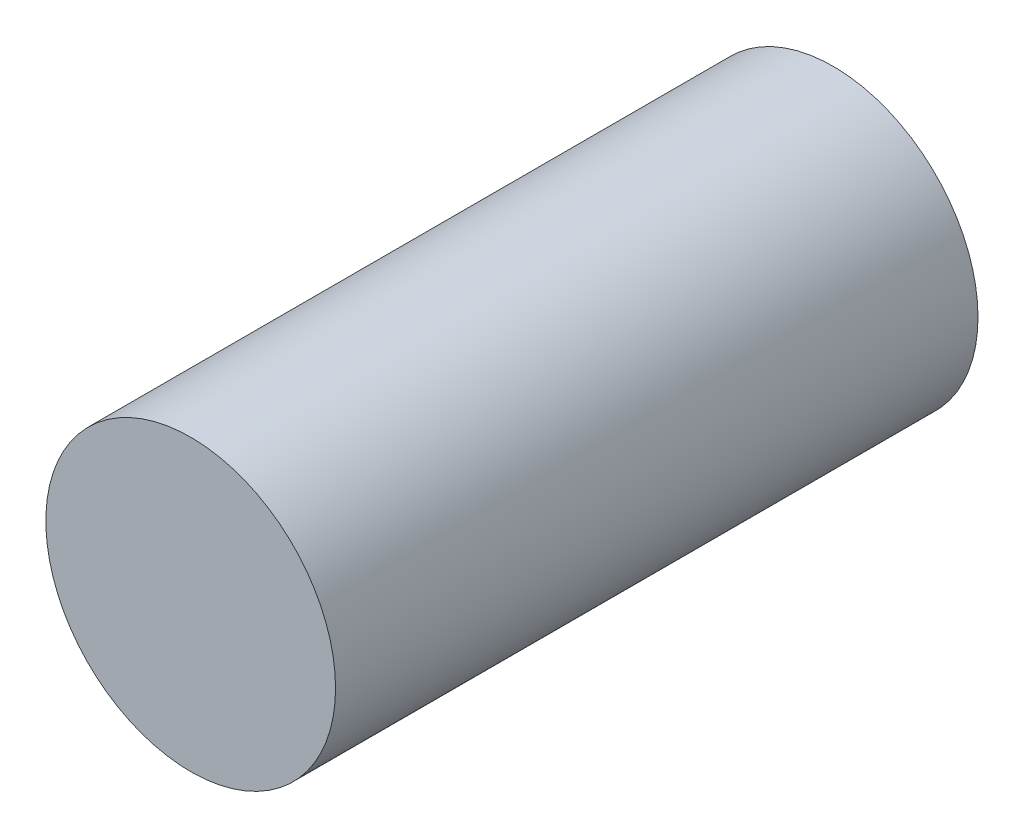
ISO-10303-21;
HEADER;
FILE_DESCRIPTION(('STEP AP214'),'2;1');
FILE_NAME('part.step','',(''),(''),'','','');
FILE_SCHEMA(('AUTOMOTIVE_DESIGN { 1 0 10303 214 1 1 1 1 }'));
ENDSEC;
DATA;
#1=APPLICATION_CONTEXT('core data for automotive mechanical design processes');
#2=APPLICATION_PROTOCOL_DEFINITION('international standard','automotive_design',2000,#1);
#3=PRODUCT_CONTEXT('',#1,'mechanical');
#4=PRODUCT('Part','Part','',(#3));
#5=PRODUCT_RELATED_PRODUCT_CATEGORY('part','',(#4));
#6=PRODUCT_DEFINITION_FORMATION('','',#4);
#7=PRODUCT_DEFINITION_CONTEXT('part definition',#1,'design');
#8=PRODUCT_DEFINITION('design','',#6,#7);
#9=PRODUCT_DEFINITION_SHAPE('','',#8);
#10=(LENGTH_UNIT() NAMED_UNIT(*) SI_UNIT(.MILLI.,.METRE.));
#11=(NAMED_UNIT(*) PLANE_ANGLE_UNIT() SI_UNIT($,.RADIAN.));
#12=(NAMED_UNIT(*) SI_UNIT($,.STERADIAN.) SOLID_ANGLE_UNIT());
#13=UNCERTAINTY_MEASURE_WITH_UNIT(LENGTH_MEASURE(1.E-05),#10,'distance_accuracy_value','');
#14=(GEOMETRIC_REPRESENTATION_CONTEXT(3) GLOBAL_UNCERTAINTY_ASSIGNED_CONTEXT((#13)) GLOBAL_UNIT_ASSIGNED_CONTEXT((#10,
#11,#12)) REPRESENTATION_CONTEXT('',''));
#15=CARTESIAN_POINT('',(0.,0.,0.));
#16=DIRECTION('',(0.,0.,1.));
#17=DIRECTION('',(1.,0.,0.));
#18=AXIS2_PLACEMENT_3D('',#15,#16,#17);
#19=CARTESIAN_POINT('',(0.,0.,17.3));
#20=DIRECTION('',(0.,0.,1.));
#21=DIRECTION('',(1.,0.,0.));
#22=AXIS2_PLACEMENT_3D('',#19,#20,#21);
#23=PLANE('',#22);
#24=CARTESIAN_POINT('',(0.,0.,17.3));
#25=DIRECTION('',(0.,0.,1.));
#26=DIRECTION('',(1.,0.,0.));
#27=AXIS2_PLACEMENT_3D('',#24,#25,#26);
#28=CIRCLE('',#27,3.675);
#29=CARTESIAN_POINT('',(3.675,0.,17.3));
#30=VERTEX_POINT('',#29);
#31=EDGE_CURVE('E18',#30,#30,#28,.F.);
#32=ORIENTED_EDGE('',*,*,#31,.F.);
#33=EDGE_LOOP('',(#32));
#34=FACE_BOUND('',#33,.T.);
#35=ADVANCED_FACE('F15',(#34),#23,.T.);
#36=CARTESIAN_POINT('',(0.,0.,1.));
#37=DIRECTION('',(0.,0.,1.));
#38=DIRECTION('',(1.,0.,0.));
#39=AXIS2_PLACEMENT_3D('',#36,#37,#38);
#40=PLANE('',#39);
#41=CARTESIAN_POINT('',(0.,0.,1.));
#42=DIRECTION('',(0.,0.,1.));
#43=DIRECTION('',(1.,0.,0.));
#44=AXIS2_PLACEMENT_3D('',#41,#42,#43);
#45=CIRCLE('',#44,3.675);
#46=CARTESIAN_POINT('',(3.675,0.,1.));
#47=VERTEX_POINT('',#46);
#48=EDGE_CURVE('E10',#47,#47,#45,.T.);
#49=ORIENTED_EDGE('',*,*,#48,.F.);
#50=EDGE_LOOP('',(#49));
#51=FACE_BOUND('',#50,.T.);
#52=ADVANCED_FACE('F30',(#51),#40,.F.);
#53=CARTESIAN_POINT('',(0.,0.,1.));
#54=DIRECTION('',(0.,0.,1.));
#55=DIRECTION('',(1.,0.,0.));
#56=AXIS2_PLACEMENT_3D('',#53,#54,#55);
#57=CYLINDRICAL_SURFACE('',#56,3.675);
#58=ORIENTED_EDGE('',*,*,#48,.T.);
#59=EDGE_LOOP('',(#58));
#60=FACE_BOUND('',#59,.T.);
#61=ORIENTED_EDGE('',*,*,#31,.T.);
#62=EDGE_LOOP('',(#61));
#63=FACE_BOUND('',#62,.T.);
#64=ADVANCED_FACE('F27',(#60,#63),#57,.T.);
#65=CLOSED_SHELL('',(#35,#52,#64));
#66=MANIFOLD_SOLID_BREP('B1',#65);
#67=ADVANCED_BREP_SHAPE_REPRESENTATION('',(#18,#66),#14);
#68=SHAPE_DEFINITION_REPRESENTATION(#9,#67);
ENDSEC;
END-ISO-10303-21;
